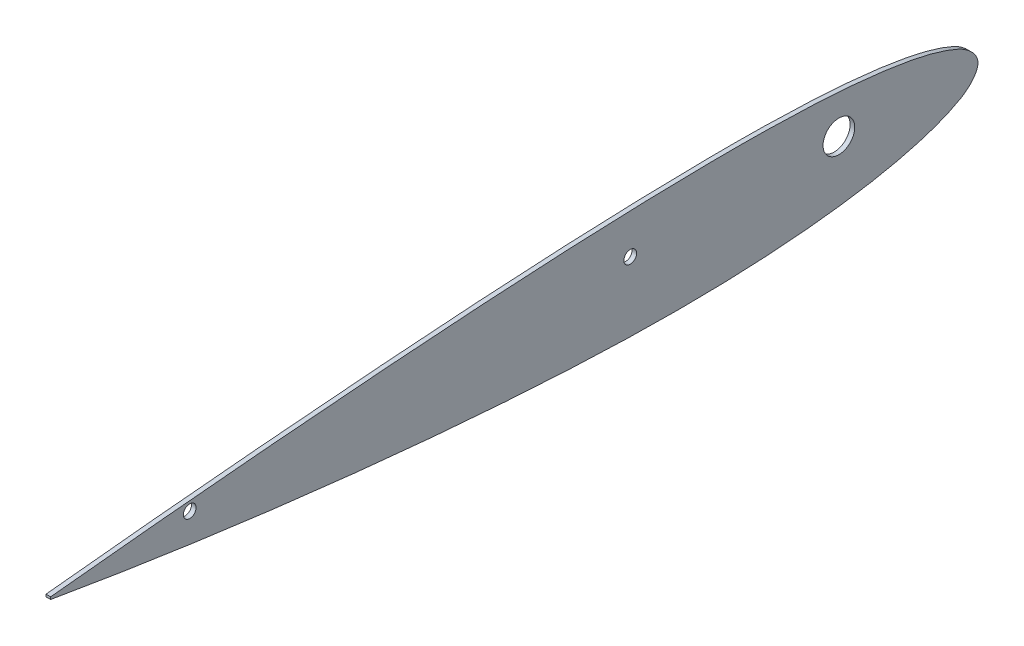
ISO-10303-21;
HEADER;
FILE_DESCRIPTION(('STEP AP214'),'2;1');
FILE_NAME('part.step','',(''),(''),'','','');
FILE_SCHEMA(('AUTOMOTIVE_DESIGN { 1 0 10303 214 1 1 1 1 }'));
ENDSEC;
DATA;
#1=APPLICATION_CONTEXT('core data for automotive mechanical design processes');
#2=APPLICATION_PROTOCOL_DEFINITION('international standard','automotive_design',2000,#1);
#3=PRODUCT_CONTEXT('',#1,'mechanical');
#4=PRODUCT('Part','Part','',(#3));
#5=PRODUCT_RELATED_PRODUCT_CATEGORY('part','',(#4));
#6=PRODUCT_DEFINITION_FORMATION('','',#4);
#7=PRODUCT_DEFINITION_CONTEXT('part definition',#1,'design');
#8=PRODUCT_DEFINITION('design','',#6,#7);
#9=PRODUCT_DEFINITION_SHAPE('','',#8);
#10=(LENGTH_UNIT() NAMED_UNIT(*) SI_UNIT(.MILLI.,.METRE.));
#11=(NAMED_UNIT(*) PLANE_ANGLE_UNIT() SI_UNIT($,.RADIAN.));
#12=(NAMED_UNIT(*) SI_UNIT($,.STERADIAN.) SOLID_ANGLE_UNIT());
#13=UNCERTAINTY_MEASURE_WITH_UNIT(LENGTH_MEASURE(1.E-05),#10,'distance_accuracy_value','');
#14=(GEOMETRIC_REPRESENTATION_CONTEXT(3) GLOBAL_UNCERTAINTY_ASSIGNED_CONTEXT((#13)) GLOBAL_UNIT_ASSIGNED_CONTEXT((#10,
#11,#12)) REPRESENTATION_CONTEXT('',''));
#15=CARTESIAN_POINT('',(0.,0.,0.));
#16=DIRECTION('',(0.,0.,1.));
#17=DIRECTION('',(1.,0.,0.));
#18=AXIS2_PLACEMENT_3D('',#15,#16,#17);
#19=CARTESIAN_POINT('',(2.,0.503992174042304,400.000313171614));
#20=CARTESIAN_POINT('',(2.,1.20827340100886,393.301544953931));
#21=CARTESIAN_POINT('',(2.,2.61509826056135,379.920535640924));
#22=CARTESIAN_POINT('',(2.,5.26204092908528,353.182419920954));
#23=CARTESIAN_POINT('',(2.,8.36048497007254,319.807747147461));
#24=CARTESIAN_POINT('',(2.,11.7769418106569,279.795689887196));
#25=CARTESIAN_POINT('',(2.,14.8714349090721,239.83985117999));
#26=CARTESIAN_POINT('',(2.,17.5162944706218,199.92592897574));
#27=CARTESIAN_POINT('',(2.,19.4977105026132,160.093873002914));
#28=CARTESIAN_POINT('',(2.,20.4474276713772,126.937018205107));
#29=CARTESIAN_POINT('',(2.,20.583142651895,100.454521437832));
#30=CARTESIAN_POINT('',(2.,20.244422573222,80.5683851009151));
#31=CARTESIAN_POINT('',(2.,19.2859043746572,60.6319168965701));
#32=CARTESIAN_POINT('',(2.,17.7491591057004,43.9855394702566));
#33=CARTESIAN_POINT('',(2.,15.7357427223296,30.6260870670138));
#34=CARTESIAN_POINT('',(2.,13.6600237212905,20.4971255760462));
#35=CARTESIAN_POINT('',(2.,10.940166720717,11.8821326359626));
#36=CARTESIAN_POINT('',(2.,7.47483493208009,4.38492530782633));
#37=CARTESIAN_POINT('',(2.,0.371292257930978,-2.44601692576104));
#38=CARTESIAN_POINT('',(2.,-7.40123528082568,3.65032236212266));
#39=CARTESIAN_POINT('',(2.,-11.5552530344191,10.8325552843253));
#40=CARTESIAN_POINT('',(2.,-15.0619479719034,19.2304132571483));
#41=CARTESIAN_POINT('',(2.,-18.0006234573957,29.2385612271778));
#42=CARTESIAN_POINT('',(2.,-21.0820421812687,42.5473689613135));
#43=CARTESIAN_POINT('',(2.,-23.769599097026,59.2658971689619));
#44=CARTESIAN_POINT('',(2.,-25.8915490900184,79.3907562963511));
#45=CARTESIAN_POINT('',(2.,-27.1185073486625,99.5342061357415));
#46=CARTESIAN_POINT('',(2.,-27.8742360043675,126.401333061515));
#47=CARTESIAN_POINT('',(2.,-27.3203250964933,159.954759758316));
#48=CARTESIAN_POINT('',(2.,-25.118222975405,200.131199498338));
#49=CARTESIAN_POINT('',(2.,-21.8612515921795,240.218827833143));
#50=CARTESIAN_POINT('',(2.,-17.7008263072649,280.261192131311));
#51=CARTESIAN_POINT('',(2.,-12.7868544707698,320.255557769241));
#52=CARTESIAN_POINT('',(2.,-8.05648261964678,353.526390030437));
#53=CARTESIAN_POINT('',(2.,-3.89731009838293,380.103644239369));
#54=CARTESIAN_POINT('',(2.,-1.63499916551679,393.368253000911));
#55=CARTESIAN_POINT('',(2.,-0.503992174042304,399.999686828386));
#56=B_SPLINE_CURVE_WITH_KNOTS('',3,(#19,#20,#21,#22,#23,#24,#25,#26,#27,#28,#29,#30,#31,#32,#33,
#34,#35,#36,#37,#38,#39,#40,#41,#42,#43,#44,#45,#46,#47,#48,#49,#50,#51,#52,#53,#54,#55),
.UNSPECIFIED.,.F.,.F.,(4,1,1,1,1,1,1,1,1,1,1,1,1,1,1,1,1,1,1,1,1,1,1,1,1,1,1,1,1,1,1,1,1,1,4),
(0.,0.0247898444409783,0.049518527668585,0.0988869468263506,0.148148302407342,0.19731261260843,
0.246378146970664,0.295363956929404,0.34408374332352,0.368442721404916,0.392825641810401,
0.41727490319434,0.441884458853984,0.454325923101425,0.466947515660677,0.480022900195665,
0.487092053261674,0.498227884101779,0.509373674616872,0.516476673346114,0.529639133387933,
0.542377969647895,0.5549439711343,0.579861194114865,0.604653843655577,0.629394084082987,
0.654115914552988,0.703559499032186,0.752843021958462,0.802183907321177,0.851568359011207,
0.900997535580195,0.950476794201679,0.975241647297708,1.),.UNSPECIFIED.);
#57=DIRECTION('',(-1.,0.,0.));
#58=VECTOR('',#57,1.);
#59=SURFACE_OF_LINEAR_EXTRUSION('',#56,#58);
#60=CARTESIAN_POINT('',(0.,0.503992174042304,400.000313171614));
#61=CARTESIAN_POINT('',(0.,1.20827340100886,393.301544953931));
#62=CARTESIAN_POINT('',(0.,2.61509826056135,379.920535640924));
#63=CARTESIAN_POINT('',(0.,5.26204092908528,353.182419920954));
#64=CARTESIAN_POINT('',(0.,8.36048497007254,319.807747147461));
#65=CARTESIAN_POINT('',(0.,11.7769418106569,279.795689887196));
#66=CARTESIAN_POINT('',(0.,14.8714349090721,239.83985117999));
#67=CARTESIAN_POINT('',(0.,17.5162944706218,199.92592897574));
#68=CARTESIAN_POINT('',(0.,19.4977105026132,160.093873002914));
#69=CARTESIAN_POINT('',(0.,20.4474276713772,126.937018205107));
#70=CARTESIAN_POINT('',(0.,20.583142651895,100.454521437832));
#71=CARTESIAN_POINT('',(0.,20.244422573222,80.5683851009151));
#72=CARTESIAN_POINT('',(0.,19.2859043746572,60.6319168965701));
#73=CARTESIAN_POINT('',(0.,17.7491591057004,43.9855394702566));
#74=CARTESIAN_POINT('',(0.,15.7357427223296,30.6260870670138));
#75=CARTESIAN_POINT('',(0.,13.6600237212905,20.4971255760462));
#76=CARTESIAN_POINT('',(0.,10.940166720717,11.8821326359626));
#77=CARTESIAN_POINT('',(0.,7.47483493208009,4.38492530782633));
#78=CARTESIAN_POINT('',(0.,0.371292257930978,-2.44601692576104));
#79=CARTESIAN_POINT('',(0.,-7.40123528082568,3.65032236212266));
#80=CARTESIAN_POINT('',(0.,-11.5552530344191,10.8325552843253));
#81=CARTESIAN_POINT('',(0.,-15.0619479719034,19.2304132571483));
#82=CARTESIAN_POINT('',(0.,-18.0006234573957,29.2385612271778));
#83=CARTESIAN_POINT('',(0.,-21.0820421812687,42.5473689613135));
#84=CARTESIAN_POINT('',(0.,-23.769599097026,59.2658971689619));
#85=CARTESIAN_POINT('',(0.,-25.8915490900184,79.3907562963511));
#86=CARTESIAN_POINT('',(0.,-27.1185073486625,99.5342061357415));
#87=CARTESIAN_POINT('',(0.,-27.8742360043675,126.401333061515));
#88=CARTESIAN_POINT('',(0.,-27.3203250964933,159.954759758316));
#89=CARTESIAN_POINT('',(0.,-25.118222975405,200.131199498338));
#90=CARTESIAN_POINT('',(0.,-21.8612515921795,240.218827833143));
#91=CARTESIAN_POINT('',(0.,-17.7008263072649,280.261192131311));
#92=CARTESIAN_POINT('',(0.,-12.7868544707698,320.255557769241));
#93=CARTESIAN_POINT('',(0.,-8.05648261964678,353.526390030437));
#94=CARTESIAN_POINT('',(0.,-3.89731009838293,380.103644239369));
#95=CARTESIAN_POINT('',(0.,-1.63499916551679,393.368253000911));
#96=CARTESIAN_POINT('',(0.,-0.503992174042304,399.999686828386));
#97=B_SPLINE_CURVE_WITH_KNOTS('',3,(#60,#61,#62,#63,#64,#65,#66,#67,#68,#69,#70,#71,#72,#73,#74,
#75,#76,#77,#78,#79,#80,#81,#82,#83,#84,#85,#86,#87,#88,#89,#90,#91,#92,#93,#94,#95,#96),
.UNSPECIFIED.,.F.,.F.,(4,1,1,1,1,1,1,1,1,1,1,1,1,1,1,1,1,1,1,1,1,1,1,1,1,1,1,1,1,1,1,1,1,1,4),
(0.,0.0247898444409783,0.049518527668585,0.0988869468263506,0.148148302407342,0.19731261260843,
0.246378146970664,0.295363956929404,0.34408374332352,0.368442721404916,0.392825641810401,
0.41727490319434,0.441884458853984,0.454325923101425,0.466947515660677,0.480022900195665,
0.487092053261674,0.498227884101779,0.509373674616872,0.516476673346114,0.529639133387933,
0.542377969647895,0.5549439711343,0.579861194114865,0.604653843655577,0.629394084082987,
0.654115914552988,0.703559499032186,0.752843021958462,0.802183907321177,0.851568359011207,
0.900997535580195,0.950476794201679,0.975241647297708,1.),.UNSPECIFIED.);
#98=CARTESIAN_POINT('',(0.,0.503992174042304,400.000313171614));
#99=VERTEX_POINT('',#98);
#100=CARTESIAN_POINT('',(0.,-0.503992174042304,399.999686828386));
#101=VERTEX_POINT('',#100);
#102=EDGE_CURVE('E67',#99,#101,#97,.T.);
#103=ORIENTED_EDGE('',*,*,#102,.F.);
#104=DIRECTION('',(-1.,0.,0.));
#105=VECTOR('',#104,1.);
#106=CARTESIAN_POINT('',(2.,0.503992174042304,400.000313171614));
#107=LINE('',#106,#105);
#108=CARTESIAN_POINT('',(2.,0.503992174042304,400.000313171614));
#109=VERTEX_POINT('',#108);
#110=EDGE_CURVE('E47',#109,#99,#107,.T.);
#111=ORIENTED_EDGE('',*,*,#110,.F.);
#112=CARTESIAN_POINT('',(2.,-0.503992174042304,399.999686828386));
#113=VERTEX_POINT('',#112);
#114=EDGE_CURVE('E68',#109,#113,#56,.T.);
#115=ORIENTED_EDGE('',*,*,#114,.T.);
#116=DIRECTION('',(-1.,0.,0.));
#117=VECTOR('',#116,1.);
#118=CARTESIAN_POINT('',(2.,-0.503992174042304,399.999686828386));
#119=LINE('',#118,#117);
#120=EDGE_CURVE('E11',#113,#101,#119,.T.);
#121=ORIENTED_EDGE('',*,*,#120,.T.);
#122=EDGE_LOOP('',(#103,#111,#115,#121));
#123=FACE_BOUND('',#122,.T.);
#124=ADVANCED_FACE('F37',(#123),#59,.T.);
#125=CARTESIAN_POINT('',(2.,0.503992174042304,400.000313171614));
#126=DIRECTION('',(0.,0.000621381778174796,-0.999999806942324));
#127=DIRECTION('',(0.,-0.999999806942324,-0.000621381778174796));
#128=AXIS2_PLACEMENT_3D('',#125,#126,#127);
#129=PLANE('',#128);
#130=DIRECTION('',(0.,0.999999806942324,0.000621381778174796));
#131=VECTOR('',#130,1.);
#132=CARTESIAN_POINT('',(0.,0.503992174042304,400.000313171614));
#133=LINE('',#132,#131);
#134=EDGE_CURVE('E62',#101,#99,#133,.T.);
#135=ORIENTED_EDGE('',*,*,#134,.F.);
#136=ORIENTED_EDGE('',*,*,#120,.F.);
#137=DIRECTION('',(0.,0.999999806942324,0.000621381778174796));
#138=VECTOR('',#137,1.);
#139=CARTESIAN_POINT('',(2.,0.503992174042304,400.000313171614));
#140=LINE('',#139,#138);
#141=EDGE_CURVE('E56',#113,#109,#140,.T.);
#142=ORIENTED_EDGE('',*,*,#141,.T.);
#143=ORIENTED_EDGE('',*,*,#110,.T.);
#144=EDGE_LOOP('',(#135,#136,#142,#143));
#145=FACE_BOUND('',#144,.T.);
#146=ADVANCED_FACE('F71',(#145),#129,.F.);
#147=CARTESIAN_POINT('',(2.,-1.10326105431103,0.115364929544274));
#148=DIRECTION('',(1.,0.,0.));
#149=DIRECTION('',(0.,0.,1.));
#150=AXIS2_PLACEMENT_3D('',#147,#148,#149);
#151=PLANE('',#150);
#152=CARTESIAN_POINT('',(2.,2.5000018824215,60.));
#153=DIRECTION('',(-1.,0.,0.));
#154=DIRECTION('',(0.,0.,1.));
#155=AXIS2_PLACEMENT_3D('',#152,#153,#154);
#156=CIRCLE('',#155,6.83635541999999);
#157=CARTESIAN_POINT('',(2.,2.5000018824215,66.83635542));
#158=VERTEX_POINT('',#157);
#159=EDGE_CURVE('E87',#158,#158,#156,.T.);
#160=ORIENTED_EDGE('',*,*,#159,.T.);
#161=EDGE_LOOP('',(#160));
#162=FACE_BOUND('',#161,.T.);
#163=CARTESIAN_POINT('',(2.,2.5000018824215,150.));
#164=DIRECTION('',(-1.,0.,0.));
#165=DIRECTION('',(0.,0.,1.));
#166=AXIS2_PLACEMENT_3D('',#163,#164,#165);
#167=CIRCLE('',#166,2.75000000000001);
#168=CARTESIAN_POINT('',(2.,2.5000018824215,152.75));
#169=VERTEX_POINT('',#168);
#170=EDGE_CURVE('E128',#169,#169,#167,.T.);
#171=ORIENTED_EDGE('',*,*,#170,.T.);
#172=EDGE_LOOP('',(#171));
#173=FACE_BOUND('',#172,.T.);
#174=CARTESIAN_POINT('',(2.,2.50000188242148,340.001541872452));
#175=DIRECTION('',(-1.,0.,0.));
#176=DIRECTION('',(0.,0.,1.));
#177=AXIS2_PLACEMENT_3D('',#174,#175,#176);
#178=CIRCLE('',#177,2.75000000000004);
#179=CARTESIAN_POINT('',(2.,2.50000188242148,342.751541872452));
#180=VERTEX_POINT('',#179);
#181=EDGE_CURVE('E131',#180,#180,#178,.T.);
#182=ORIENTED_EDGE('',*,*,#181,.T.);
#183=EDGE_LOOP('',(#182));
#184=FACE_BOUND('',#183,.T.);
#185=ORIENTED_EDGE('',*,*,#114,.F.);
#186=ORIENTED_EDGE('',*,*,#141,.F.);
#187=EDGE_LOOP('',(#185,#186));
#188=FACE_BOUND('',#187,.T.);
#189=ADVANCED_FACE('F96',(#162,#173,#184,#188),#151,.T.);
#190=CARTESIAN_POINT('',(0.,-1.10326105431103,0.115364929544274));
#191=DIRECTION('',(1.,0.,0.));
#192=DIRECTION('',(0.,0.,1.));
#193=AXIS2_PLACEMENT_3D('',#190,#191,#192);
#194=PLANE('',#193);
#195=CARTESIAN_POINT('',(0.,2.5000018824215,60.));
#196=DIRECTION('',(-1.,0.,0.));
#197=DIRECTION('',(0.,0.,1.));
#198=AXIS2_PLACEMENT_3D('',#195,#196,#197);
#199=CIRCLE('',#198,6.83635541999999);
#200=CARTESIAN_POINT('',(0.,2.5000018824215,66.83635542));
#201=VERTEX_POINT('',#200);
#202=EDGE_CURVE('E41',#201,#201,#199,.T.);
#203=ORIENTED_EDGE('',*,*,#202,.F.);
#204=EDGE_LOOP('',(#203));
#205=FACE_BOUND('',#204,.T.);
#206=CARTESIAN_POINT('',(0.,2.5000018824215,150.));
#207=DIRECTION('',(-1.,0.,0.));
#208=DIRECTION('',(0.,0.,1.));
#209=AXIS2_PLACEMENT_3D('',#206,#207,#208);
#210=CIRCLE('',#209,2.75000000000001);
#211=CARTESIAN_POINT('',(0.,2.5000018824215,152.75));
#212=VERTEX_POINT('',#211);
#213=EDGE_CURVE('E77',#212,#212,#210,.T.);
#214=ORIENTED_EDGE('',*,*,#213,.F.);
#215=EDGE_LOOP('',(#214));
#216=FACE_BOUND('',#215,.T.);
#217=CARTESIAN_POINT('',(0.,2.50000188242148,340.001541872452));
#218=DIRECTION('',(-1.,0.,0.));
#219=DIRECTION('',(0.,0.,1.));
#220=AXIS2_PLACEMENT_3D('',#217,#218,#219);
#221=CIRCLE('',#220,2.75000000000004);
#222=CARTESIAN_POINT('',(0.,2.50000188242148,342.751541872452));
#223=VERTEX_POINT('',#222);
#224=EDGE_CURVE('E85',#223,#223,#221,.T.);
#225=ORIENTED_EDGE('',*,*,#224,.F.);
#226=EDGE_LOOP('',(#225));
#227=FACE_BOUND('',#226,.T.);
#228=ORIENTED_EDGE('',*,*,#102,.T.);
#229=ORIENTED_EDGE('',*,*,#134,.T.);
#230=EDGE_LOOP('',(#228,#229));
#231=FACE_BOUND('',#230,.T.);
#232=ADVANCED_FACE('F65',(#205,#216,#227,#231),#194,.F.);
#233=CARTESIAN_POINT('',(-1.2E-05,2.50000188242148,340.001541872452));
#234=DIRECTION('',(1.,0.,0.));
#235=DIRECTION('',(0.,0.,1.));
#236=AXIS2_PLACEMENT_3D('',#233,#234,#235);
#237=CYLINDRICAL_SURFACE('',#236,2.75000000000004);
#238=CARTESIAN_POINT('',(2.,2.50000188242148,342.751541872452));
#239=CARTESIAN_POINT('',(1.97916666666667,2.50000188242148,342.751541872452));
#240=CARTESIAN_POINT('',(1.95833333333333,2.50000188242148,342.751541872452));
#241=CARTESIAN_POINT('',(1.91666666666667,2.50000188242148,342.751541872452));
#242=CARTESIAN_POINT('',(1.89583333333333,2.50000188242148,342.751541872452));
#243=CARTESIAN_POINT('',(1.85416666666667,2.50000188242148,342.751541872452));
#244=CARTESIAN_POINT('',(1.83333333333333,2.50000188242148,342.751541872452));
#245=CARTESIAN_POINT('',(1.79166666666667,2.50000188242148,342.751541872452));
#246=CARTESIAN_POINT('',(1.77083333333333,2.50000188242148,342.751541872452));
#247=CARTESIAN_POINT('',(1.72916666666667,2.50000188242148,342.751541872452));
#248=CARTESIAN_POINT('',(1.70833333333333,2.50000188242148,342.751541872452));
#249=CARTESIAN_POINT('',(1.66666666666667,2.50000188242148,342.751541872452));
#250=CARTESIAN_POINT('',(1.64583333333333,2.50000188242148,342.751541872452));
#251=CARTESIAN_POINT('',(1.60416666666667,2.50000188242148,342.751541872452));
#252=CARTESIAN_POINT('',(1.58333333333333,2.50000188242148,342.751541872452));
#253=CARTESIAN_POINT('',(1.54166666666667,2.50000188242148,342.751541872452));
#254=CARTESIAN_POINT('',(1.52083333333333,2.50000188242148,342.751541872452));
#255=CARTESIAN_POINT('',(1.47916666666667,2.50000188242148,342.751541872452));
#256=CARTESIAN_POINT('',(1.45833333333333,2.50000188242148,342.751541872452));
#257=CARTESIAN_POINT('',(1.41666666666667,2.50000188242148,342.751541872452));
#258=CARTESIAN_POINT('',(1.39583333333333,2.50000188242148,342.751541872452));
#259=CARTESIAN_POINT('',(1.35416666666667,2.50000188242148,342.751541872452));
#260=CARTESIAN_POINT('',(1.33333333333333,2.50000188242148,342.751541872452));
#261=CARTESIAN_POINT('',(1.29166666666667,2.50000188242148,342.751541872452));
#262=CARTESIAN_POINT('',(1.27083333333333,2.50000188242148,342.751541872452));
#263=CARTESIAN_POINT('',(1.22916666666667,2.50000188242148,342.751541872452));
#264=CARTESIAN_POINT('',(1.20833333333333,2.50000188242148,342.751541872452));
#265=CARTESIAN_POINT('',(1.16666666666667,2.50000188242148,342.751541872452));
#266=CARTESIAN_POINT('',(1.14583333333333,2.50000188242148,342.751541872452));
#267=CARTESIAN_POINT('',(1.10416666666667,2.50000188242148,342.751541872452));
#268=CARTESIAN_POINT('',(1.08333333333333,2.50000188242148,342.751541872452));
#269=CARTESIAN_POINT('',(1.04166666666667,2.50000188242148,342.751541872452));
#270=CARTESIAN_POINT('',(1.02083333333333,2.50000188242148,342.751541872452));
#271=CARTESIAN_POINT('',(0.979166666666667,2.50000188242148,342.751541872452));
#272=CARTESIAN_POINT('',(0.958333333333334,2.50000188242148,342.751541872452));
#273=CARTESIAN_POINT('',(0.916666666666667,2.50000188242148,342.751541872452));
#274=CARTESIAN_POINT('',(0.895833333333334,2.50000188242148,342.751541872452));
#275=CARTESIAN_POINT('',(0.854166666666667,2.50000188242148,342.751541872452));
#276=CARTESIAN_POINT('',(0.833333333333334,2.50000188242148,342.751541872452));
#277=CARTESIAN_POINT('',(0.791666666666667,2.50000188242148,342.751541872452));
#278=CARTESIAN_POINT('',(0.770833333333334,2.50000188242148,342.751541872452));
#279=CARTESIAN_POINT('',(0.729166666666667,2.50000188242148,342.751541872452));
#280=CARTESIAN_POINT('',(0.708333333333334,2.50000188242148,342.751541872452));
#281=CARTESIAN_POINT('',(0.666666666666667,2.50000188242148,342.751541872452));
#282=CARTESIAN_POINT('',(0.645833333333334,2.50000188242148,342.751541872452));
#283=CARTESIAN_POINT('',(0.604166666666667,2.50000188242148,342.751541872452));
#284=CARTESIAN_POINT('',(0.583333333333333,2.50000188242148,342.751541872452));
#285=CARTESIAN_POINT('',(0.541666666666667,2.50000188242148,342.751541872452));
#286=CARTESIAN_POINT('',(0.520833333333333,2.50000188242148,342.751541872452));
#287=CARTESIAN_POINT('',(0.479166666666667,2.50000188242148,342.751541872452));
#288=CARTESIAN_POINT('',(0.458333333333334,2.50000188242148,342.751541872452));
#289=CARTESIAN_POINT('',(0.416666666666667,2.50000188242148,342.751541872452));
#290=CARTESIAN_POINT('',(0.395833333333334,2.50000188242148,342.751541872452));
#291=CARTESIAN_POINT('',(0.354166666666667,2.50000188242148,342.751541872452));
#292=CARTESIAN_POINT('',(0.333333333333334,2.50000188242148,342.751541872452));
#293=CARTESIAN_POINT('',(0.291666666666667,2.50000188242148,342.751541872452));
#294=CARTESIAN_POINT('',(0.270833333333333,2.50000188242148,342.751541872452));
#295=CARTESIAN_POINT('',(0.229166666666667,2.50000188242148,342.751541872452));
#296=CARTESIAN_POINT('',(0.208333333333333,2.50000188242148,342.751541872452));
#297=CARTESIAN_POINT('',(0.166666666666667,2.50000188242148,342.751541872452));
#298=CARTESIAN_POINT('',(0.145833333333334,2.50000188242148,342.751541872452));
#299=CARTESIAN_POINT('',(0.104166666666667,2.50000188242148,342.751541872452));
#300=CARTESIAN_POINT('',(0.0833333333333336,2.50000188242148,342.751541872452));
#301=CARTESIAN_POINT('',(0.0416666666666669,2.50000188242148,342.751541872452));
#302=CARTESIAN_POINT('',(0.0208333333333335,2.50000188242148,342.751541872452));
#303=CARTESIAN_POINT('',(0.,2.50000188242148,342.751541872452));
#304=B_SPLINE_CURVE_WITH_KNOTS('',3,(#238,#239,#240,#241,#242,#243,#244,#245,#246,#247,#248,
#249,#250,#251,#252,#253,#254,#255,#256,#257,#258,#259,#260,#261,#262,#263,#264,#265,#266,#267,
#268,#269,#270,#271,#272,#273,#274,#275,#276,#277,#278,#279,#280,#281,#282,#283,#284,#285,#286,
#287,#288,#289,#290,#291,#292,#293,#294,#295,#296,#297,#298,#299,#300,#301,#302,#303),
.UNSPECIFIED.,.F.,.F.,(4,2,2,2,2,2,2,2,2,2,2,2,2,2,2,2,2,2,2,2,2,2,2,2,2,2,2,2,2,2,2,2,4),(0.,
0.0624999999999996,0.125,0.1875,0.25,0.3125,0.375,0.4375,0.5,0.5625,0.625,0.6875,0.75,0.8125,
0.875,0.9375,1.,1.0625,1.125,1.1875,1.25,1.3125,1.375,1.4375,1.5,1.5625,1.625,1.6875,1.75,
1.8125,1.875,1.9375,2.),.UNSPECIFIED.);
#305=EDGE_CURVE('BSEAM95',#180,#223,#304,.T.);
#306=ORIENTED_EDGE('',*,*,#181,.F.);
#307=ORIENTED_EDGE('',*,*,#224,.T.);
#308=ORIENTED_EDGE('',*,*,#305,.T.);
#309=ORIENTED_EDGE('',*,*,#305,.F.);
#310=EDGE_LOOP('',(#306,#308,#307,#309));
#311=FACE_BOUND('',#310,.T.);
#312=ADVANCED_FACE('F95',(#311),#237,.F.);
#313=CARTESIAN_POINT('',(-1.2E-05,2.5000018824215,150.));
#314=DIRECTION('',(1.,0.,0.));
#315=DIRECTION('',(0.,0.,1.));
#316=AXIS2_PLACEMENT_3D('',#313,#314,#315);
#317=CYLINDRICAL_SURFACE('',#316,2.75000000000001);
#318=CARTESIAN_POINT('',(2.,2.5000018824215,152.75));
#319=CARTESIAN_POINT('',(1.97916666666667,2.5000018824215,152.75));
#320=CARTESIAN_POINT('',(1.95833333333333,2.5000018824215,152.75));
#321=CARTESIAN_POINT('',(1.91666666666667,2.5000018824215,152.75));
#322=CARTESIAN_POINT('',(1.89583333333333,2.5000018824215,152.75));
#323=CARTESIAN_POINT('',(1.85416666666667,2.5000018824215,152.75));
#324=CARTESIAN_POINT('',(1.83333333333333,2.5000018824215,152.75));
#325=CARTESIAN_POINT('',(1.79166666666667,2.5000018824215,152.75));
#326=CARTESIAN_POINT('',(1.77083333333333,2.5000018824215,152.75));
#327=CARTESIAN_POINT('',(1.72916666666667,2.5000018824215,152.75));
#328=CARTESIAN_POINT('',(1.70833333333333,2.5000018824215,152.75));
#329=CARTESIAN_POINT('',(1.66666666666667,2.5000018824215,152.75));
#330=CARTESIAN_POINT('',(1.64583333333333,2.5000018824215,152.75));
#331=CARTESIAN_POINT('',(1.60416666666667,2.5000018824215,152.75));
#332=CARTESIAN_POINT('',(1.58333333333333,2.5000018824215,152.75));
#333=CARTESIAN_POINT('',(1.54166666666667,2.5000018824215,152.75));
#334=CARTESIAN_POINT('',(1.52083333333333,2.5000018824215,152.75));
#335=CARTESIAN_POINT('',(1.47916666666667,2.5000018824215,152.75));
#336=CARTESIAN_POINT('',(1.45833333333333,2.5000018824215,152.75));
#337=CARTESIAN_POINT('',(1.41666666666667,2.5000018824215,152.75));
#338=CARTESIAN_POINT('',(1.39583333333333,2.5000018824215,152.75));
#339=CARTESIAN_POINT('',(1.35416666666667,2.5000018824215,152.75));
#340=CARTESIAN_POINT('',(1.33333333333333,2.5000018824215,152.75));
#341=CARTESIAN_POINT('',(1.29166666666667,2.5000018824215,152.75));
#342=CARTESIAN_POINT('',(1.27083333333333,2.5000018824215,152.75));
#343=CARTESIAN_POINT('',(1.22916666666667,2.5000018824215,152.75));
#344=CARTESIAN_POINT('',(1.20833333333333,2.5000018824215,152.75));
#345=CARTESIAN_POINT('',(1.16666666666667,2.5000018824215,152.75));
#346=CARTESIAN_POINT('',(1.14583333333333,2.5000018824215,152.75));
#347=CARTESIAN_POINT('',(1.10416666666667,2.5000018824215,152.75));
#348=CARTESIAN_POINT('',(1.08333333333333,2.5000018824215,152.75));
#349=CARTESIAN_POINT('',(1.04166666666667,2.5000018824215,152.75));
#350=CARTESIAN_POINT('',(1.02083333333333,2.5000018824215,152.75));
#351=CARTESIAN_POINT('',(0.979166666666667,2.5000018824215,152.75));
#352=CARTESIAN_POINT('',(0.958333333333334,2.5000018824215,152.75));
#353=CARTESIAN_POINT('',(0.916666666666667,2.5000018824215,152.75));
#354=CARTESIAN_POINT('',(0.895833333333334,2.5000018824215,152.75));
#355=CARTESIAN_POINT('',(0.854166666666667,2.5000018824215,152.75));
#356=CARTESIAN_POINT('',(0.833333333333334,2.5000018824215,152.75));
#357=CARTESIAN_POINT('',(0.791666666666667,2.5000018824215,152.75));
#358=CARTESIAN_POINT('',(0.770833333333334,2.5000018824215,152.75));
#359=CARTESIAN_POINT('',(0.729166666666667,2.5000018824215,152.75));
#360=CARTESIAN_POINT('',(0.708333333333334,2.5000018824215,152.75));
#361=CARTESIAN_POINT('',(0.666666666666667,2.5000018824215,152.75));
#362=CARTESIAN_POINT('',(0.645833333333334,2.5000018824215,152.75));
#363=CARTESIAN_POINT('',(0.604166666666667,2.5000018824215,152.75));
#364=CARTESIAN_POINT('',(0.583333333333333,2.5000018824215,152.75));
#365=CARTESIAN_POINT('',(0.541666666666667,2.5000018824215,152.75));
#366=CARTESIAN_POINT('',(0.520833333333333,2.5000018824215,152.75));
#367=CARTESIAN_POINT('',(0.479166666666667,2.5000018824215,152.75));
#368=CARTESIAN_POINT('',(0.458333333333334,2.5000018824215,152.75));
#369=CARTESIAN_POINT('',(0.416666666666667,2.5000018824215,152.75));
#370=CARTESIAN_POINT('',(0.395833333333334,2.5000018824215,152.75));
#371=CARTESIAN_POINT('',(0.354166666666667,2.5000018824215,152.75));
#372=CARTESIAN_POINT('',(0.333333333333334,2.5000018824215,152.75));
#373=CARTESIAN_POINT('',(0.291666666666667,2.5000018824215,152.75));
#374=CARTESIAN_POINT('',(0.270833333333333,2.5000018824215,152.75));
#375=CARTESIAN_POINT('',(0.229166666666667,2.5000018824215,152.75));
#376=CARTESIAN_POINT('',(0.208333333333333,2.5000018824215,152.75));
#377=CARTESIAN_POINT('',(0.166666666666667,2.5000018824215,152.75));
#378=CARTESIAN_POINT('',(0.145833333333334,2.5000018824215,152.75));
#379=CARTESIAN_POINT('',(0.104166666666667,2.5000018824215,152.75));
#380=CARTESIAN_POINT('',(0.0833333333333336,2.5000018824215,152.75));
#381=CARTESIAN_POINT('',(0.0416666666666669,2.5000018824215,152.75));
#382=CARTESIAN_POINT('',(0.0208333333333335,2.5000018824215,152.75));
#383=CARTESIAN_POINT('',(0.,2.5000018824215,152.75));
#384=B_SPLINE_CURVE_WITH_KNOTS('',3,(#318,#319,#320,#321,#322,#323,#324,#325,#326,#327,#328,
#329,#330,#331,#332,#333,#334,#335,#336,#337,#338,#339,#340,#341,#342,#343,#344,#345,#346,#347,
#348,#349,#350,#351,#352,#353,#354,#355,#356,#357,#358,#359,#360,#361,#362,#363,#364,#365,#366,
#367,#368,#369,#370,#371,#372,#373,#374,#375,#376,#377,#378,#379,#380,#381,#382,#383),
.UNSPECIFIED.,.F.,.F.,(4,2,2,2,2,2,2,2,2,2,2,2,2,2,2,2,2,2,2,2,2,2,2,2,2,2,2,2,2,2,2,2,4),(0.,
0.0624999999999996,0.125,0.1875,0.25,0.3125,0.375,0.4375,0.5,0.5625,0.625,0.6875,0.75,0.8125,
0.875,0.9375,1.,1.0625,1.125,1.1875,1.25,1.3125,1.375,1.4375,1.5,1.5625,1.625,1.6875,1.75,
1.8125,1.875,1.9375,2.),.UNSPECIFIED.);
#385=EDGE_CURVE('BSEAM91',#169,#212,#384,.T.);
#386=ORIENTED_EDGE('',*,*,#170,.F.);
#387=ORIENTED_EDGE('',*,*,#213,.T.);
#388=ORIENTED_EDGE('',*,*,#385,.T.);
#389=ORIENTED_EDGE('',*,*,#385,.F.);
#390=EDGE_LOOP('',(#386,#388,#387,#389));
#391=FACE_BOUND('',#390,.T.);
#392=ADVANCED_FACE('F91',(#391),#317,.F.);
#393=CARTESIAN_POINT('',(-1.2E-05,2.5000018824215,60.));
#394=DIRECTION('',(1.,0.,0.));
#395=DIRECTION('',(0.,0.,1.));
#396=AXIS2_PLACEMENT_3D('',#393,#394,#395);
#397=CYLINDRICAL_SURFACE('',#396,6.83635541999999);
#398=CARTESIAN_POINT('',(2.,2.5000018824215,66.83635542));
#399=CARTESIAN_POINT('',(1.97916666666667,2.5000018824215,66.83635542));
#400=CARTESIAN_POINT('',(1.95833333333333,2.5000018824215,66.83635542));
#401=CARTESIAN_POINT('',(1.91666666666667,2.5000018824215,66.83635542));
#402=CARTESIAN_POINT('',(1.89583333333333,2.5000018824215,66.83635542));
#403=CARTESIAN_POINT('',(1.85416666666667,2.5000018824215,66.83635542));
#404=CARTESIAN_POINT('',(1.83333333333333,2.5000018824215,66.83635542));
#405=CARTESIAN_POINT('',(1.79166666666667,2.5000018824215,66.83635542));
#406=CARTESIAN_POINT('',(1.77083333333333,2.5000018824215,66.83635542));
#407=CARTESIAN_POINT('',(1.72916666666667,2.5000018824215,66.83635542));
#408=CARTESIAN_POINT('',(1.70833333333333,2.5000018824215,66.83635542));
#409=CARTESIAN_POINT('',(1.66666666666667,2.5000018824215,66.83635542));
#410=CARTESIAN_POINT('',(1.64583333333333,2.5000018824215,66.83635542));
#411=CARTESIAN_POINT('',(1.60416666666667,2.5000018824215,66.83635542));
#412=CARTESIAN_POINT('',(1.58333333333333,2.5000018824215,66.83635542));
#413=CARTESIAN_POINT('',(1.54166666666667,2.5000018824215,66.83635542));
#414=CARTESIAN_POINT('',(1.52083333333333,2.5000018824215,66.83635542));
#415=CARTESIAN_POINT('',(1.47916666666667,2.5000018824215,66.83635542));
#416=CARTESIAN_POINT('',(1.45833333333333,2.5000018824215,66.83635542));
#417=CARTESIAN_POINT('',(1.41666666666667,2.5000018824215,66.83635542));
#418=CARTESIAN_POINT('',(1.39583333333333,2.5000018824215,66.83635542));
#419=CARTESIAN_POINT('',(1.35416666666667,2.5000018824215,66.83635542));
#420=CARTESIAN_POINT('',(1.33333333333333,2.5000018824215,66.83635542));
#421=CARTESIAN_POINT('',(1.29166666666667,2.5000018824215,66.83635542));
#422=CARTESIAN_POINT('',(1.27083333333333,2.5000018824215,66.83635542));
#423=CARTESIAN_POINT('',(1.22916666666667,2.5000018824215,66.83635542));
#424=CARTESIAN_POINT('',(1.20833333333333,2.5000018824215,66.83635542));
#425=CARTESIAN_POINT('',(1.16666666666667,2.5000018824215,66.83635542));
#426=CARTESIAN_POINT('',(1.14583333333333,2.5000018824215,66.83635542));
#427=CARTESIAN_POINT('',(1.10416666666667,2.5000018824215,66.83635542));
#428=CARTESIAN_POINT('',(1.08333333333333,2.5000018824215,66.83635542));
#429=CARTESIAN_POINT('',(1.04166666666667,2.5000018824215,66.83635542));
#430=CARTESIAN_POINT('',(1.02083333333333,2.5000018824215,66.83635542));
#431=CARTESIAN_POINT('',(0.979166666666667,2.5000018824215,66.83635542));
#432=CARTESIAN_POINT('',(0.958333333333334,2.5000018824215,66.83635542));
#433=CARTESIAN_POINT('',(0.916666666666667,2.5000018824215,66.83635542));
#434=CARTESIAN_POINT('',(0.895833333333334,2.5000018824215,66.83635542));
#435=CARTESIAN_POINT('',(0.854166666666667,2.5000018824215,66.83635542));
#436=CARTESIAN_POINT('',(0.833333333333334,2.5000018824215,66.83635542));
#437=CARTESIAN_POINT('',(0.791666666666667,2.5000018824215,66.83635542));
#438=CARTESIAN_POINT('',(0.770833333333334,2.5000018824215,66.83635542));
#439=CARTESIAN_POINT('',(0.729166666666667,2.5000018824215,66.83635542));
#440=CARTESIAN_POINT('',(0.708333333333334,2.5000018824215,66.83635542));
#441=CARTESIAN_POINT('',(0.666666666666667,2.5000018824215,66.83635542));
#442=CARTESIAN_POINT('',(0.645833333333334,2.5000018824215,66.83635542));
#443=CARTESIAN_POINT('',(0.604166666666667,2.5000018824215,66.83635542));
#444=CARTESIAN_POINT('',(0.583333333333333,2.5000018824215,66.83635542));
#445=CARTESIAN_POINT('',(0.541666666666667,2.5000018824215,66.83635542));
#446=CARTESIAN_POINT('',(0.520833333333333,2.5000018824215,66.83635542));
#447=CARTESIAN_POINT('',(0.479166666666667,2.5000018824215,66.83635542));
#448=CARTESIAN_POINT('',(0.458333333333334,2.5000018824215,66.83635542));
#449=CARTESIAN_POINT('',(0.416666666666667,2.5000018824215,66.83635542));
#450=CARTESIAN_POINT('',(0.395833333333334,2.5000018824215,66.83635542));
#451=CARTESIAN_POINT('',(0.354166666666667,2.5000018824215,66.83635542));
#452=CARTESIAN_POINT('',(0.333333333333334,2.5000018824215,66.83635542));
#453=CARTESIAN_POINT('',(0.291666666666667,2.5000018824215,66.83635542));
#454=CARTESIAN_POINT('',(0.270833333333333,2.5000018824215,66.83635542));
#455=CARTESIAN_POINT('',(0.229166666666667,2.5000018824215,66.83635542));
#456=CARTESIAN_POINT('',(0.208333333333333,2.5000018824215,66.83635542));
#457=CARTESIAN_POINT('',(0.166666666666667,2.5000018824215,66.83635542));
#458=CARTESIAN_POINT('',(0.145833333333334,2.5000018824215,66.83635542));
#459=CARTESIAN_POINT('',(0.104166666666667,2.5000018824215,66.83635542));
#460=CARTESIAN_POINT('',(0.0833333333333336,2.5000018824215,66.83635542));
#461=CARTESIAN_POINT('',(0.0416666666666669,2.5000018824215,66.83635542));
#462=CARTESIAN_POINT('',(0.0208333333333335,2.5000018824215,66.83635542));
#463=CARTESIAN_POINT('',(0.,2.5000018824215,66.83635542));
#464=B_SPLINE_CURVE_WITH_KNOTS('',3,(#398,#399,#400,#401,#402,#403,#404,#405,#406,#407,#408,
#409,#410,#411,#412,#413,#414,#415,#416,#417,#418,#419,#420,#421,#422,#423,#424,#425,#426,#427,
#428,#429,#430,#431,#432,#433,#434,#435,#436,#437,#438,#439,#440,#441,#442,#443,#444,#445,#446,
#447,#448,#449,#450,#451,#452,#453,#454,#455,#456,#457,#458,#459,#460,#461,#462,#463),
.UNSPECIFIED.,.F.,.F.,(4,2,2,2,2,2,2,2,2,2,2,2,2,2,2,2,2,2,2,2,2,2,2,2,2,2,2,2,2,2,2,2,4),(0.,
0.0624999999999996,0.125,0.1875,0.25,0.3125,0.375,0.4375,0.5,0.5625,0.625,0.6875,0.75,0.8125,
0.875,0.9375,1.,1.0625,1.125,1.1875,1.25,1.3125,1.375,1.4375,1.5,1.5625,1.625,1.6875,1.75,
1.8125,1.875,1.9375,2.),.UNSPECIFIED.);
#465=EDGE_CURVE('BSEAM107',#158,#201,#464,.T.);
#466=ORIENTED_EDGE('',*,*,#159,.F.);
#467=ORIENTED_EDGE('',*,*,#202,.T.);
#468=ORIENTED_EDGE('',*,*,#465,.T.);
#469=ORIENTED_EDGE('',*,*,#465,.F.);
#470=EDGE_LOOP('',(#466,#468,#467,#469));
#471=FACE_BOUND('',#470,.T.);
#472=ADVANCED_FACE('F107',(#471),#397,.F.);
#473=CLOSED_SHELL('',(#124,#146,#189,#232,#312,#392,#472));
#474=MANIFOLD_SOLID_BREP('B2',#473);
#475=ADVANCED_BREP_SHAPE_REPRESENTATION('',(#18,#474),#14);
#476=SHAPE_DEFINITION_REPRESENTATION(#9,#475);
ENDSEC;
END-ISO-10303-21;
